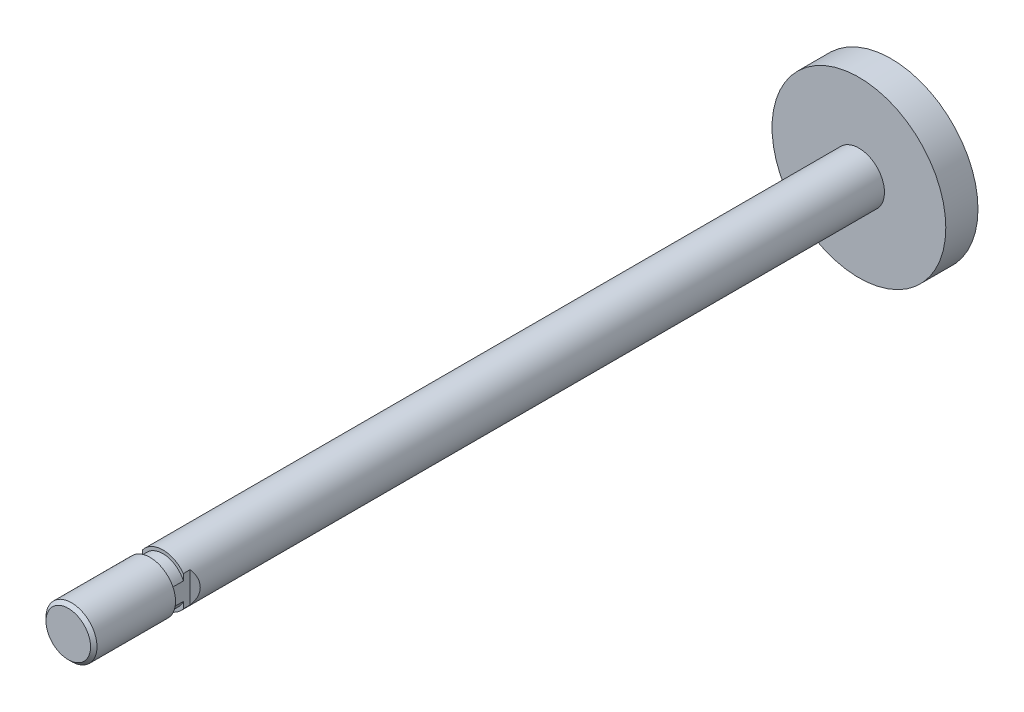
ISO-10303-21;
HEADER;
FILE_DESCRIPTION(('STEP AP214'),'2;1');
FILE_NAME('part.step','',(''),(''),'','','');
FILE_SCHEMA(('AUTOMOTIVE_DESIGN { 1 0 10303 214 1 1 1 1 }'));
ENDSEC;
DATA;
#1=APPLICATION_CONTEXT('core data for automotive mechanical design processes');
#2=APPLICATION_PROTOCOL_DEFINITION('international standard','automotive_design',2000,#1);
#3=PRODUCT_CONTEXT('',#1,'mechanical');
#4=PRODUCT('Part','Part','',(#3));
#5=PRODUCT_RELATED_PRODUCT_CATEGORY('part','',(#4));
#6=PRODUCT_DEFINITION_FORMATION('','',#4);
#7=PRODUCT_DEFINITION_CONTEXT('part definition',#1,'design');
#8=PRODUCT_DEFINITION('design','',#6,#7);
#9=PRODUCT_DEFINITION_SHAPE('','',#8);
#10=(LENGTH_UNIT() NAMED_UNIT(*) SI_UNIT(.MILLI.,.METRE.));
#11=(NAMED_UNIT(*) PLANE_ANGLE_UNIT() SI_UNIT($,.RADIAN.));
#12=(NAMED_UNIT(*) SI_UNIT($,.STERADIAN.) SOLID_ANGLE_UNIT());
#13=UNCERTAINTY_MEASURE_WITH_UNIT(LENGTH_MEASURE(1.E-05),#10,'distance_accuracy_value','');
#14=(GEOMETRIC_REPRESENTATION_CONTEXT(3) GLOBAL_UNCERTAINTY_ASSIGNED_CONTEXT((#13)) GLOBAL_UNIT_ASSIGNED_CONTEXT((#10,
#11,#12)) REPRESENTATION_CONTEXT('',''));
#15=CARTESIAN_POINT('',(0.,0.,0.));
#16=DIRECTION('',(0.,0.,1.));
#17=DIRECTION('',(1.,0.,0.));
#18=AXIS2_PLACEMENT_3D('',#15,#16,#17);
#19=CARTESIAN_POINT('',(0.,3.45999999999999,110.5855));
#20=DIRECTION('',(0.,0.,-1.));
#21=DIRECTION('',(-1.,0.,0.));
#22=AXIS2_PLACEMENT_3D('',#19,#20,#21);
#23=PLANE('',#22);
#24=CARTESIAN_POINT('',(0.,0.,110.5855));
#25=DIRECTION('',(0.,0.,-1.));
#26=DIRECTION('',(-1.,0.,0.));
#27=AXIS2_PLACEMENT_3D('',#24,#25,#26);
#28=CIRCLE('',#27,3.9624);
#29=CARTESIAN_POINT('',(-3.17499999999998,2.37065154757087,110.5855));
#30=VERTEX_POINT('',#29);
#31=CARTESIAN_POINT('',(3.17500000000001,2.37065154757083,110.5855));
#32=VERTEX_POINT('',#31);
#33=EDGE_CURVE('E134',#30,#32,#28,.T.);
#34=ORIENTED_EDGE('',*,*,#33,.F.);
#35=DIRECTION('',(0.,-1.,0.));
#36=VECTOR('',#35,1.);
#37=CARTESIAN_POINT('',(-3.17499999999998,3.45999999999999,110.5855));
#38=LINE('',#37,#36);
#39=CARTESIAN_POINT('',(-3.17500000000001,1.37512726683747,110.5855));
#40=VERTEX_POINT('',#39);
#41=EDGE_CURVE('E178',#30,#40,#38,.T.);
#42=ORIENTED_EDGE('',*,*,#41,.T.);
#43=CARTESIAN_POINT('',(0.,0.,110.5855));
#44=DIRECTION('',(0.,0.,-1.));
#45=DIRECTION('',(-1.,0.,0.));
#46=AXIS2_PLACEMENT_3D('',#43,#44,#45);
#47=CIRCLE('',#46,3.45999999999999);
#48=CARTESIAN_POINT('',(3.17500000000001,1.37512726683748,110.5855));
#49=VERTEX_POINT('',#48);
#50=EDGE_CURVE('E113',#40,#49,#47,.T.);
#51=ORIENTED_EDGE('',*,*,#50,.T.);
#52=DIRECTION('',(0.,1.,0.));
#53=VECTOR('',#52,1.);
#54=CARTESIAN_POINT('',(3.17500000000001,3.45999999999999,110.5855));
#55=LINE('',#54,#53);
#56=EDGE_CURVE('E165',#49,#32,#55,.T.);
#57=ORIENTED_EDGE('',*,*,#56,.T.);
#58=EDGE_LOOP('',(#34,#42,#51,#57));
#59=FACE_BOUND('',#58,.T.);
#60=ADVANCED_FACE('F36',(#59),#23,.F.);
#61=CARTESIAN_POINT('',(0.,0.,0.));
#62=DIRECTION('',(0.,0.,-1.));
#63=DIRECTION('',(-1.,0.,0.));
#64=AXIS2_PLACEMENT_3D('',#61,#62,#63);
#65=CYLINDRICAL_SURFACE('',#64,3.45999999999999);
#66=CARTESIAN_POINT('',(0.,0.,112.5855));
#67=DIRECTION('',(0.,0.,-1.));
#68=DIRECTION('',(-1.,0.,0.));
#69=AXIS2_PLACEMENT_3D('',#66,#67,#68);
#70=CIRCLE('',#69,3.45999999999999);
#71=CARTESIAN_POINT('',(3.17500000000001,-1.37512726683748,112.5855));
#72=VERTEX_POINT('',#71);
#73=CARTESIAN_POINT('',(-3.17499999999998,-1.37512726683754,112.5855));
#74=VERTEX_POINT('',#73);
#75=EDGE_CURVE('E118',#72,#74,#70,.T.);
#76=ORIENTED_EDGE('',*,*,#75,.T.);
#77=DIRECTION('',(0.,0.,-1.));
#78=VECTOR('',#77,1.);
#79=CARTESIAN_POINT('',(-3.17500000000001,-1.37512726683747,0.));
#80=LINE('',#79,#78);
#81=CARTESIAN_POINT('',(-3.17500000000001,-1.37512726683747,110.5855));
#82=VERTEX_POINT('',#81);
#83=EDGE_CURVE('E44',#74,#82,#80,.T.);
#84=ORIENTED_EDGE('',*,*,#83,.T.);
#85=CARTESIAN_POINT('',(3.17500000000001,-1.37512726683748,110.5855));
#86=VERTEX_POINT('',#85);
#87=EDGE_CURVE('E119',#86,#82,#47,.T.);
#88=ORIENTED_EDGE('',*,*,#87,.F.);
#89=DIRECTION('',(0.,0.,-1.));
#90=VECTOR('',#89,1.);
#91=CARTESIAN_POINT('',(3.17500000000001,-1.37512726683748,0.));
#92=LINE('',#91,#90);
#93=EDGE_CURVE('E145',#86,#72,#92,.F.);
#94=ORIENTED_EDGE('',*,*,#93,.T.);
#95=EDGE_LOOP('',(#76,#84,#88,#94));
#96=FACE_BOUND('',#95,.T.);
#97=ADVANCED_FACE('F153',(#96),#65,.T.);
#98=CARTESIAN_POINT('',(0.,0.,2.5));
#99=DIRECTION('',(0.,0.,1.));
#100=DIRECTION('',(1.,0.,0.));
#101=AXIS2_PLACEMENT_3D('',#98,#99,#100);
#102=PLANE('',#101);
#103=CARTESIAN_POINT('',(0.,0.,2.5));
#104=DIRECTION('',(0.,0.,1.));
#105=DIRECTION('',(1.,0.,0.));
#106=AXIS2_PLACEMENT_3D('',#103,#104,#105);
#107=CIRCLE('',#106,13.49375);
#108=CARTESIAN_POINT('',(13.49375,0.,2.5));
#109=VERTEX_POINT('',#108);
#110=EDGE_CURVE('E135',#109,#109,#107,.T.);
#111=ORIENTED_EDGE('',*,*,#110,.T.);
#112=EDGE_LOOP('',(#111));
#113=FACE_BOUND('',#112,.T.);
#114=CARTESIAN_POINT('',(0.,0.,2.5));
#115=DIRECTION('',(0.,0.,1.));
#116=DIRECTION('',(1.,0.,0.));
#117=AXIS2_PLACEMENT_3D('',#114,#115,#116);
#118=CIRCLE('',#117,3.9624);
#119=CARTESIAN_POINT('',(3.9624,0.,2.5));
#120=VERTEX_POINT('',#119);
#121=EDGE_CURVE('E138',#120,#120,#118,.T.);
#122=ORIENTED_EDGE('',*,*,#121,.F.);
#123=EDGE_LOOP('',(#122));
#124=FACE_BOUND('',#123,.T.);
#125=ADVANCED_FACE('F212',(#113,#124),#102,.T.);
#126=CARTESIAN_POINT('',(0.,0.,2.5));
#127=DIRECTION('',(0.,0.,-1.));
#128=DIRECTION('',(-1.,0.,0.));
#129=AXIS2_PLACEMENT_3D('',#126,#127,#128);
#130=CYLINDRICAL_SURFACE('',#129,13.49375);
#131=ORIENTED_EDGE('',*,*,#110,.F.);
#132=EDGE_LOOP('',(#131));
#133=FACE_BOUND('',#132,.T.);
#134=CARTESIAN_POINT('',(0.,0.,-2.5));
#135=DIRECTION('',(0.,0.,1.));
#136=DIRECTION('',(1.,0.,0.));
#137=AXIS2_PLACEMENT_3D('',#134,#135,#136);
#138=CIRCLE('',#137,13.49375);
#139=CARTESIAN_POINT('',(13.49375,0.,-2.5));
#140=VERTEX_POINT('',#139);
#141=EDGE_CURVE('E139',#140,#140,#138,.T.);
#142=ORIENTED_EDGE('',*,*,#141,.T.);
#143=EDGE_LOOP('',(#142));
#144=FACE_BOUND('',#143,.T.);
#145=ADVANCED_FACE('F227',(#133,#144),#130,.T.);
#146=CARTESIAN_POINT('',(0.,0.,-2.5));
#147=DIRECTION('',(0.,0.,1.));
#148=DIRECTION('',(1.,0.,0.));
#149=AXIS2_PLACEMENT_3D('',#146,#147,#148);
#150=PLANE('',#149);
#151=ORIENTED_EDGE('',*,*,#141,.F.);
#152=EDGE_LOOP('',(#151));
#153=FACE_BOUND('',#152,.T.);
#154=ADVANCED_FACE('F223',(#153),#150,.F.);
#155=CARTESIAN_POINT('',(0.,0.,136.492859639094));
#156=DIRECTION('',(0.,0.,-1.));
#157=DIRECTION('',(-1.,0.,0.));
#158=AXIS2_PLACEMENT_3D('',#155,#156,#157);
#159=CYLINDRICAL_SURFACE('',#158,3.9624);
#160=CARTESIAN_POINT('',(0.,0.,112.7125));
#161=DIRECTION('',(0.707106781186546,0.,-0.707106781186549));
#162=DIRECTION('',(-0.707106781186549,0.,-0.707106781186546));
#163=AXIS2_PLACEMENT_3D('',#160,#161,#162);
#164=ELLIPSE('',#163,5.60367981954714,3.9624);
#165=CARTESIAN_POINT('',(-3.17499999999998,-2.37065154757088,109.5375));
#166=VERTEX_POINT('',#165);
#167=CARTESIAN_POINT('',(-3.17499999999998,2.37065154757088,109.5375));
#168=VERTEX_POINT('',#167);
#169=EDGE_CURVE('E12',#166,#168,#164,.T.);
#170=ORIENTED_EDGE('',*,*,#169,.T.);
#171=DIRECTION('',(0.,0.,-1.));
#172=VECTOR('',#171,1.);
#173=CARTESIAN_POINT('',(-3.17499999999997,2.37065154757088,136.492859639094));
#174=LINE('',#173,#172);
#175=EDGE_CURVE('E187',#168,#30,#174,.F.);
#176=ORIENTED_EDGE('',*,*,#175,.T.);
#177=ORIENTED_EDGE('',*,*,#33,.T.);
#178=DIRECTION('',(0.,0.,-1.));
#179=VECTOR('',#178,1.);
#180=CARTESIAN_POINT('',(3.17500000000001,2.37065154757083,136.492859639094));
#181=LINE('',#180,#179);
#182=CARTESIAN_POINT('',(3.17500000000001,2.37065154757083,109.5375));
#183=VERTEX_POINT('',#182);
#184=EDGE_CURVE('E171',#32,#183,#181,.T.);
#185=ORIENTED_EDGE('',*,*,#184,.T.);
#186=CARTESIAN_POINT('',(0.,0.,112.7125));
#187=DIRECTION('',(-0.707106781186547,0.,-0.707106781186548));
#188=DIRECTION('',(0.707106781186548,0.,-0.707106781186547));
#189=AXIS2_PLACEMENT_3D('',#186,#187,#188);
#190=ELLIPSE('',#189,5.60367981954715,3.9624);
#191=CARTESIAN_POINT('',(3.17500000000001,-2.37065154757083,109.5375));
#192=VERTEX_POINT('',#191);
#193=EDGE_CURVE('E114',#183,#192,#190,.T.);
#194=ORIENTED_EDGE('',*,*,#193,.T.);
#195=DIRECTION('',(0.,0.,-1.));
#196=VECTOR('',#195,1.);
#197=CARTESIAN_POINT('',(3.17500000000001,-2.37065154757083,136.492859639094));
#198=LINE('',#197,#196);
#199=CARTESIAN_POINT('',(3.17500000000001,-2.37065154757083,110.5855));
#200=VERTEX_POINT('',#199);
#201=EDGE_CURVE('E163',#192,#200,#198,.F.);
#202=ORIENTED_EDGE('',*,*,#201,.T.);
#203=CARTESIAN_POINT('',(-3.17499999999998,-2.37065154757087,110.5855));
#204=VERTEX_POINT('',#203);
#205=EDGE_CURVE('E142',#200,#204,#28,.T.);
#206=ORIENTED_EDGE('',*,*,#205,.T.);
#207=DIRECTION('',(0.,0.,-1.));
#208=VECTOR('',#207,1.);
#209=CARTESIAN_POINT('',(-3.17499999999997,-2.37065154757088,136.492859639094));
#210=LINE('',#209,#208);
#211=EDGE_CURVE('E183',#204,#166,#210,.T.);
#212=ORIENTED_EDGE('',*,*,#211,.T.);
#213=EDGE_LOOP('',(#170,#176,#177,#185,#194,#202,#206,#212));
#214=FACE_BOUND('',#213,.T.);
#215=ORIENTED_EDGE('',*,*,#121,.T.);
#216=EDGE_LOOP('',(#215));
#217=FACE_BOUND('',#216,.T.);
#218=ADVANCED_FACE('F38',(#214,#217),#159,.T.);
#219=ORIENTED_EDGE('',*,*,#87,.T.);
#220=EDGE_CURVE('E159',#82,#204,#38,.T.);
#221=ORIENTED_EDGE('',*,*,#220,.T.);
#222=ORIENTED_EDGE('',*,*,#205,.F.);
#223=EDGE_CURVE('E160',#200,#86,#55,.T.);
#224=ORIENTED_EDGE('',*,*,#223,.T.);
#225=EDGE_LOOP('',(#219,#221,#222,#224));
#226=FACE_BOUND('',#225,.T.);
#227=ADVANCED_FACE('F157',(#226),#23,.F.);
#228=CARTESIAN_POINT('',(0.,0.,125.2855));
#229=DIRECTION('',(0.,0.,-1.));
#230=DIRECTION('',(-1.,0.,0.));
#231=AXIS2_PLACEMENT_3D('',#228,#229,#230);
#232=CONICAL_SURFACE('',#231,3.45999999999999,0.785398163397451);
#233=CARTESIAN_POINT('',(0.,0.,124.7855));
#234=DIRECTION('',(0.,0.,-1.));
#235=DIRECTION('',(-1.,0.,0.));
#236=AXIS2_PLACEMENT_3D('',#233,#234,#235);
#237=CIRCLE('',#236,3.95999999999999);
#238=CARTESIAN_POINT('',(-3.95999999999999,0.,124.7855));
#239=VERTEX_POINT('',#238);
#240=EDGE_CURVE('E128',#239,#239,#237,.T.);
#241=ORIENTED_EDGE('',*,*,#240,.F.);
#242=EDGE_LOOP('',(#241));
#243=FACE_BOUND('',#242,.T.);
#244=CARTESIAN_POINT('',(0.,0.,125.2855));
#245=DIRECTION('',(0.,0.,-1.));
#246=DIRECTION('',(-1.,0.,0.));
#247=AXIS2_PLACEMENT_3D('',#244,#245,#246);
#248=CIRCLE('',#247,3.45999999999999);
#249=CARTESIAN_POINT('',(-3.45999999999999,0.,125.2855));
#250=VERTEX_POINT('',#249);
#251=EDGE_CURVE('E131',#250,#250,#248,.T.);
#252=ORIENTED_EDGE('',*,*,#251,.T.);
#253=EDGE_LOOP('',(#252));
#254=FACE_BOUND('',#253,.T.);
#255=ADVANCED_FACE('F215',(#243,#254),#232,.T.);
#256=CARTESIAN_POINT('',(0.,0.,0.));
#257=DIRECTION('',(0.,0.,-1.));
#258=DIRECTION('',(-1.,0.,0.));
#259=AXIS2_PLACEMENT_3D('',#256,#257,#258);
#260=CYLINDRICAL_SURFACE('',#259,3.95999999999999);
#261=CARTESIAN_POINT('',(0.,0.,112.5855));
#262=DIRECTION('',(0.,0.,-1.));
#263=DIRECTION('',(-1.,0.,0.));
#264=AXIS2_PLACEMENT_3D('',#261,#262,#263);
#265=CIRCLE('',#264,3.95999999999999);
#266=CARTESIAN_POINT('',(-3.95999999999999,0.,112.5855));
#267=VERTEX_POINT('',#266);
#268=EDGE_CURVE('E121',#267,#267,#265,.T.);
#269=ORIENTED_EDGE('',*,*,#268,.F.);
#270=EDGE_LOOP('',(#269));
#271=FACE_BOUND('',#270,.T.);
#272=ORIENTED_EDGE('',*,*,#240,.T.);
#273=EDGE_LOOP('',(#272));
#274=FACE_BOUND('',#273,.T.);
#275=ADVANCED_FACE('F220',(#271,#274),#260,.T.);
#276=CARTESIAN_POINT('',(0.,3.95999999999999,112.5855));
#277=DIRECTION('',(0.,0.,1.));
#278=DIRECTION('',(1.,0.,0.));
#279=AXIS2_PLACEMENT_3D('',#276,#277,#278);
#280=PLANE('',#279);
#281=DIRECTION('',(0.,1.,0.));
#282=VECTOR('',#281,1.);
#283=CARTESIAN_POINT('',(-3.17499999999998,-13.49375,112.5855));
#284=LINE('',#283,#282);
#285=CARTESIAN_POINT('',(-3.17499999999998,1.37512726683754,112.5855));
#286=VERTEX_POINT('',#285);
#287=EDGE_CURVE('E51',#74,#286,#284,.T.);
#288=ORIENTED_EDGE('',*,*,#287,.F.);
#289=ORIENTED_EDGE('',*,*,#75,.F.);
#290=DIRECTION('',(0.,1.,0.));
#291=VECTOR('',#290,1.);
#292=CARTESIAN_POINT('',(3.17500000000001,-13.49375,112.5855));
#293=LINE('',#292,#291);
#294=CARTESIAN_POINT('',(3.17500000000001,1.37512726683748,112.5855));
#295=VERTEX_POINT('',#294);
#296=EDGE_CURVE('E59',#72,#295,#293,.T.);
#297=ORIENTED_EDGE('',*,*,#296,.T.);
#298=EDGE_CURVE('E112',#286,#295,#70,.T.);
#299=ORIENTED_EDGE('',*,*,#298,.F.);
#300=EDGE_LOOP('',(#288,#289,#297,#299));
#301=FACE_BOUND('',#300,.T.);
#302=ORIENTED_EDGE('',*,*,#268,.T.);
#303=EDGE_LOOP('',(#302));
#304=FACE_BOUND('',#303,.T.);
#305=ADVANCED_FACE('F116',(#301,#304),#280,.F.);
#306=ORIENTED_EDGE('',*,*,#50,.F.);
#307=DIRECTION('',(0.,0.,-1.));
#308=VECTOR('',#307,1.);
#309=CARTESIAN_POINT('',(-3.17500000000001,1.37512726683747,0.));
#310=LINE('',#309,#308);
#311=EDGE_CURVE('E102',#40,#286,#310,.F.);
#312=ORIENTED_EDGE('',*,*,#311,.T.);
#313=ORIENTED_EDGE('',*,*,#298,.T.);
#314=DIRECTION('',(0.,0.,-1.));
#315=VECTOR('',#314,1.);
#316=CARTESIAN_POINT('',(3.17500000000001,1.37512726683748,0.));
#317=LINE('',#316,#315);
#318=EDGE_CURVE('E149',#295,#49,#317,.T.);
#319=ORIENTED_EDGE('',*,*,#318,.T.);
#320=EDGE_LOOP('',(#306,#312,#313,#319));
#321=FACE_BOUND('',#320,.T.);
#322=ADVANCED_FACE('F110',(#321),#65,.T.);
#323=CARTESIAN_POINT('',(0.,0.,125.2855));
#324=DIRECTION('',(0.,0.,-1.));
#325=DIRECTION('',(-1.,0.,0.));
#326=AXIS2_PLACEMENT_3D('',#323,#324,#325);
#327=PLANE('',#326);
#328=ORIENTED_EDGE('',*,*,#251,.F.);
#329=EDGE_LOOP('',(#328));
#330=FACE_BOUND('',#329,.T.);
#331=ADVANCED_FACE('F199',(#330),#327,.F.);
#332=CARTESIAN_POINT('',(3.17500000000001,-13.49375,109.5375));
#333=DIRECTION('',(-0.707106781186547,0.,-0.707106781186548));
#334=DIRECTION('',(-0.707106781186548,0.,0.707106781186547));
#335=AXIS2_PLACEMENT_3D('',#332,#333,#334);
#336=PLANE('',#335);
#337=ORIENTED_EDGE('',*,*,#193,.F.);
#338=DIRECTION('',(0.,1.,0.));
#339=VECTOR('',#338,1.);
#340=CARTESIAN_POINT('',(3.17500000000001,-13.49375,109.5375));
#341=LINE('',#340,#339);
#342=EDGE_CURVE('E167',#192,#183,#341,.T.);
#343=ORIENTED_EDGE('',*,*,#342,.F.);
#344=EDGE_LOOP('',(#337,#343));
#345=FACE_BOUND('',#344,.T.);
#346=ADVANCED_FACE('F197',(#345),#336,.F.);
#347=CARTESIAN_POINT('',(3.17500000000001,-13.49375,112.5855));
#348=DIRECTION('',(-1.,0.,0.));
#349=DIRECTION('',(0.,0.,1.));
#350=AXIS2_PLACEMENT_3D('',#347,#348,#349);
#351=PLANE('',#350);
#352=ORIENTED_EDGE('',*,*,#56,.F.);
#353=ORIENTED_EDGE('',*,*,#318,.F.);
#354=ORIENTED_EDGE('',*,*,#296,.F.);
#355=ORIENTED_EDGE('',*,*,#93,.F.);
#356=ORIENTED_EDGE('',*,*,#223,.F.);
#357=ORIENTED_EDGE('',*,*,#201,.F.);
#358=ORIENTED_EDGE('',*,*,#342,.T.);
#359=ORIENTED_EDGE('',*,*,#184,.F.);
#360=EDGE_LOOP('',(#352,#353,#354,#355,#356,#357,#358,#359));
#361=FACE_BOUND('',#360,.T.);
#362=ADVANCED_FACE('F179',(#361),#351,.F.);
#363=CARTESIAN_POINT('',(-3.17499999999998,-13.49375,109.5375));
#364=DIRECTION('',(0.707106781186546,0.,-0.707106781186549));
#365=DIRECTION('',(-0.707106781186549,0.,-0.707106781186546));
#366=AXIS2_PLACEMENT_3D('',#363,#364,#365);
#367=PLANE('',#366);
#368=ORIENTED_EDGE('',*,*,#169,.F.);
#369=DIRECTION('',(0.,1.,0.));
#370=VECTOR('',#369,1.);
#371=CARTESIAN_POINT('',(-3.17499999999998,-13.49375,109.5375));
#372=LINE('',#371,#370);
#373=EDGE_CURVE('E106',#166,#168,#372,.T.);
#374=ORIENTED_EDGE('',*,*,#373,.T.);
#375=EDGE_LOOP('',(#368,#374));
#376=FACE_BOUND('',#375,.T.);
#377=ADVANCED_FACE('F194',(#376),#367,.F.);
#378=CARTESIAN_POINT('',(-3.17499999999998,-13.49375,112.5855));
#379=DIRECTION('',(1.,0.,0.));
#380=DIRECTION('',(0.,0.,-1.));
#381=AXIS2_PLACEMENT_3D('',#378,#379,#380);
#382=PLANE('',#381);
#383=ORIENTED_EDGE('',*,*,#220,.F.);
#384=ORIENTED_EDGE('',*,*,#83,.F.);
#385=ORIENTED_EDGE('',*,*,#287,.T.);
#386=ORIENTED_EDGE('',*,*,#311,.F.);
#387=ORIENTED_EDGE('',*,*,#41,.F.);
#388=ORIENTED_EDGE('',*,*,#175,.F.);
#389=ORIENTED_EDGE('',*,*,#373,.F.);
#390=ORIENTED_EDGE('',*,*,#211,.F.);
#391=EDGE_LOOP('',(#383,#384,#385,#386,#387,#388,#389,#390));
#392=FACE_BOUND('',#391,.T.);
#393=ADVANCED_FACE('F101',(#392),#382,.F.);
#394=CLOSED_SHELL('',(#60,#97,#125,#145,#154,#218,#227,#255,#275,#305,#322,#331,#346,#362,#377,#393));
#395=MANIFOLD_SOLID_BREP('B2',#394);
#396=ADVANCED_BREP_SHAPE_REPRESENTATION('',(#18,#395),#14);
#397=SHAPE_DEFINITION_REPRESENTATION(#9,#396);
ENDSEC;
END-ISO-10303-21;
